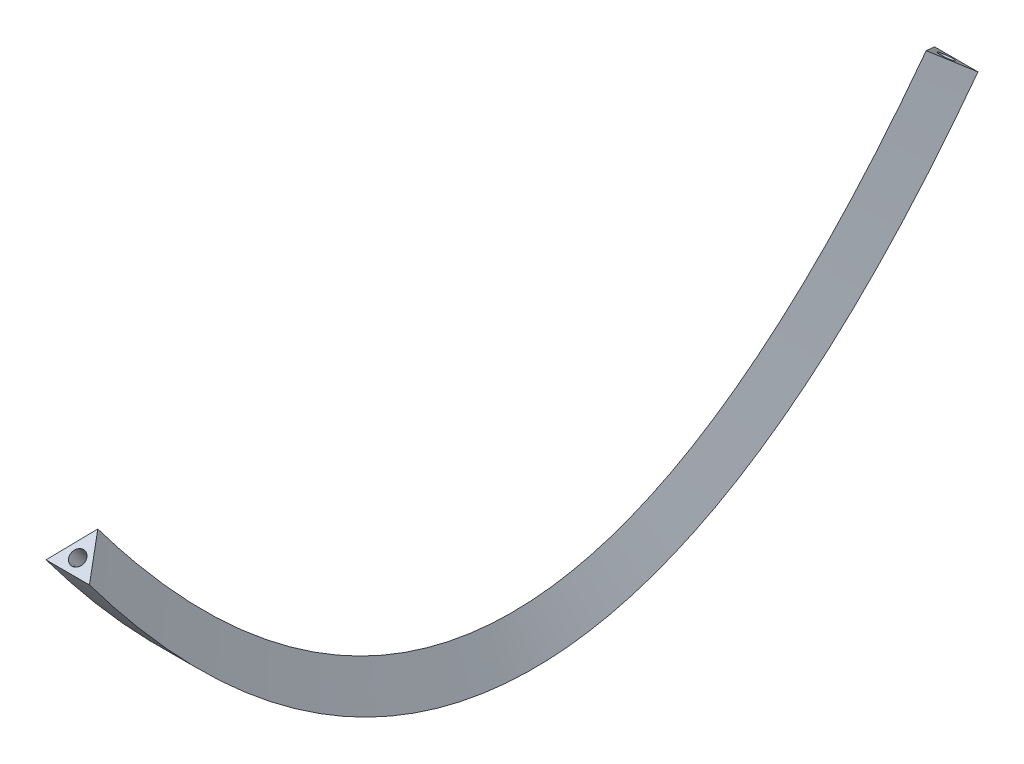
ISO-10303-21;
HEADER;
FILE_DESCRIPTION(('STEP AP214'),'2;1');
FILE_NAME('part.step','',(''),(''),'','','');
FILE_SCHEMA(('AUTOMOTIVE_DESIGN { 1 0 10303 214 1 1 1 1 }'));
ENDSEC;
DATA;
#1=APPLICATION_CONTEXT('core data for automotive mechanical design processes');
#2=APPLICATION_PROTOCOL_DEFINITION('international standard','automotive_design',2000,#1);
#3=PRODUCT_CONTEXT('',#1,'mechanical');
#4=PRODUCT('Part','Part','',(#3));
#5=PRODUCT_RELATED_PRODUCT_CATEGORY('part','',(#4));
#6=PRODUCT_DEFINITION_FORMATION('','',#4);
#7=PRODUCT_DEFINITION_CONTEXT('part definition',#1,'design');
#8=PRODUCT_DEFINITION('design','',#6,#7);
#9=PRODUCT_DEFINITION_SHAPE('','',#8);
#10=(LENGTH_UNIT() NAMED_UNIT(*) SI_UNIT(.MILLI.,.METRE.));
#11=(NAMED_UNIT(*) PLANE_ANGLE_UNIT() SI_UNIT($,.RADIAN.));
#12=(NAMED_UNIT(*) SI_UNIT($,.STERADIAN.) SOLID_ANGLE_UNIT());
#13=UNCERTAINTY_MEASURE_WITH_UNIT(LENGTH_MEASURE(1.E-05),#10,'distance_accuracy_value','');
#14=(GEOMETRIC_REPRESENTATION_CONTEXT(3) GLOBAL_UNCERTAINTY_ASSIGNED_CONTEXT((#13)) GLOBAL_UNIT_ASSIGNED_CONTEXT((#10,
#11,#12)) REPRESENTATION_CONTEXT('',''));
#15=CARTESIAN_POINT('',(0.,0.,0.));
#16=DIRECTION('',(0.,0.,1.));
#17=DIRECTION('',(1.,0.,0.));
#18=AXIS2_PLACEMENT_3D('',#15,#16,#17);
#19=CARTESIAN_POINT('',(15.,194.803847577293,-306.928203230275));
#20=CARTESIAN_POINT('',(15.,161.193482046376,-281.720429085412));
#21=CARTESIAN_POINT('',(15.,131.716475432373,-256.463922400366));
#22=CARTESIAN_POINT('',(15.,81.0360598245672,-205.783498417588));
#23=CARTESIAN_POINT('',(15.,59.8304179636023,-180.358110520362));
#24=CARTESIAN_POINT('',(15.,25.7580340814775,-129.249525894402));
#25=CARTESIAN_POINT('',(15.,12.8913522660172,-103.560167415296));
#26=CARTESIAN_POINT('',(15.,-4.32303403146759,-51.9170074384153));
#27=CARTESIAN_POINT('',(15.,-8.66025403780102,-25.9622360285769));
#28=CARTESIAN_POINT('',(15.,-8.66025403788775,25.9622648684316));
#29=CARTESIAN_POINT('',(15.,-4.323031917837,51.9170504644026));
#30=CARTESIAN_POINT('',(15.,12.8913602329809,103.560225832018));
#31=CARTESIAN_POINT('',(15.,25.7580457255587,129.249583807579));
#32=CARTESIAN_POINT('',(15.,59.8304345444556,180.358158234299));
#33=CARTESIAN_POINT('',(15.,81.0360776437553,205.783536477832));
#34=CARTESIAN_POINT('',(15.,131.716489671484,256.463940132063));
#35=CARTESIAN_POINT('',(15.,161.193491489031,281.720436168416));
#36=CARTESIAN_POINT('',(15.,194.803847577293,306.928203230275));
#37=CARTESIAN_POINT('',(0.,210.392304845413,-286.143593539449));
#38=CARTESIAN_POINT('',(0.,177.613022551272,-261.559131819855));
#39=CARTESIAN_POINT('',(0.,149.067029115684,-237.072129772899));
#40=CARTESIAN_POINT('',(0.,100.427855318388,-188.432947938692));
#41=CARTESIAN_POINT('',(0.,80.3391407120265,-164.283709368444));
#42=CARTESIAN_POINT('',(0.,48.4839151515491,-116.500862798088));
#43=CARTESIAN_POINT('',(0.,36.7172837878244,-92.8795783031034));
#44=CARTESIAN_POINT('',(0.,21.1460647257272,-46.1659201360645));
#45=CARTESIAN_POINT('',(0.,17.3205080757321,-23.0754862860122));
#46=CARTESIAN_POINT('',(0.,17.3205080756454,23.0755119191537));
#47=CARTESIAN_POINT('',(0.,21.1460671729631,46.1659640591198));
#48=CARTESIAN_POINT('',(0.,36.7172912141086,92.8796352015341));
#49=CARTESIAN_POINT('',(0.,48.4839252355572,116.500917797657));
#50=CARTESIAN_POINT('',(0.,80.3391542707064,164.283753122618));
#51=CARTESIAN_POINT('',(0.,100.427869743745,188.432982267045));
#52=CARTESIAN_POINT('',(0.,149.067040677855,237.072145165716));
#53=CARTESIAN_POINT('',(0.,177.61303036623,261.559137684254));
#54=CARTESIAN_POINT('',(0.,210.392304845413,286.143593539449));
#55=B_SPLINE_SURFACE_WITH_KNOTS('',1,3,((#19,#20,#21,#22,#23,#24,#25,#26,#27,#28,#29,#30,#31,
#32,#33,#34,#35,#36),(#37,#38,#39,#40,#41,#42,#43,#44,#45,#46,#47,#48,#49,#50,#51,#52,#53,#54)),
.UNSPECIFIED.,.F.,.F.,.F.,(2,2),(4,2,2,2,2,2,2,2,4),(0.,1.),(0.,0.124999930572624,
0.249999861145248,0.374999791717873,0.499999722290497,0.624999791717873,0.749999861145249,
0.874999930572624,1.),.UNSPECIFIED.);
#56=CARTESIAN_POINT('',(0.,210.392304845413,-286.143593539449));
#57=CARTESIAN_POINT('',(0.,177.613022551272,-261.559131819855));
#58=CARTESIAN_POINT('',(0.,149.067029115684,-237.072129772899));
#59=CARTESIAN_POINT('',(0.,100.427855318388,-188.432947938692));
#60=CARTESIAN_POINT('',(0.,80.3391407120265,-164.283709368444));
#61=CARTESIAN_POINT('',(0.,48.4839151515491,-116.500862798088));
#62=CARTESIAN_POINT('',(0.,36.7172837878244,-92.8795783031034));
#63=CARTESIAN_POINT('',(0.,21.1460647257272,-46.1659201360645));
#64=CARTESIAN_POINT('',(0.,17.3205080757321,-23.0754862860122));
#65=CARTESIAN_POINT('',(0.,17.3205080756454,23.0755119191537));
#66=CARTESIAN_POINT('',(0.,21.1460671729631,46.1659640591198));
#67=CARTESIAN_POINT('',(0.,36.7172912141086,92.8796352015341));
#68=CARTESIAN_POINT('',(0.,48.4839252355572,116.500917797657));
#69=CARTESIAN_POINT('',(0.,80.3391542707064,164.283753122618));
#70=CARTESIAN_POINT('',(0.,100.427869743745,188.432982267045));
#71=CARTESIAN_POINT('',(0.,149.067040677855,237.072145165716));
#72=CARTESIAN_POINT('',(0.,177.61303036623,261.559137684254));
#73=CARTESIAN_POINT('',(0.,210.392304845413,286.143593539449));
#74=B_SPLINE_CURVE_WITH_KNOTS('',3,(#56,#57,#58,#59,#60,#61,#62,#63,#64,#65,#66,#67,#68,#69,#70,
#71,#72,#73),.UNSPECIFIED.,.F.,.F.,(4,2,2,2,2,2,2,2,4),(0.,0.124999930572624,0.249999861145248,
0.374999791717873,0.499999722290497,0.624999791717873,0.749999861145249,0.874999930572624,1.),.UNSPECIFIED.);
#75=CARTESIAN_POINT('',(0.,210.392304845413,-286.143593539449));
#76=VERTEX_POINT('',#75);
#77=CARTESIAN_POINT('',(0.,210.392304845413,286.143593539449));
#78=VERTEX_POINT('',#77);
#79=EDGE_CURVE('E91',#76,#78,#74,.T.);
#80=DIRECTION('',(-0.5,0.519615242270663,-0.692820323027551));
#81=VECTOR('',#80,1.);
#82=CARTESIAN_POINT('',(15.,194.803847577293,306.928203230275));
#83=LINE('',#82,#81);
#84=CARTESIAN_POINT('',(15.,194.803847577293,306.928203230275));
#85=VERTEX_POINT('',#84);
#86=EDGE_CURVE('E88',#85,#78,#83,.T.);
#87=CARTESIAN_POINT('',(15.,194.803847577293,-306.928203230275));
#88=CARTESIAN_POINT('',(15.,161.193482046376,-281.720429085412));
#89=CARTESIAN_POINT('',(15.,131.716475432373,-256.463922400366));
#90=CARTESIAN_POINT('',(15.,81.0360598245672,-205.783498417588));
#91=CARTESIAN_POINT('',(15.,59.8304179636023,-180.358110520362));
#92=CARTESIAN_POINT('',(15.,25.7580340814775,-129.249525894402));
#93=CARTESIAN_POINT('',(15.,12.8913522660172,-103.560167415296));
#94=CARTESIAN_POINT('',(15.,-4.32303403146759,-51.9170074384153));
#95=CARTESIAN_POINT('',(15.,-8.66025403780102,-25.9622360285769));
#96=CARTESIAN_POINT('',(15.,-8.66025403788775,25.9622648684316));
#97=CARTESIAN_POINT('',(15.,-4.323031917837,51.9170504644026));
#98=CARTESIAN_POINT('',(15.,12.8913602329809,103.560225832018));
#99=CARTESIAN_POINT('',(15.,25.7580457255587,129.249583807579));
#100=CARTESIAN_POINT('',(15.,59.8304345444556,180.358158234299));
#101=CARTESIAN_POINT('',(15.,81.0360776437553,205.783536477832));
#102=CARTESIAN_POINT('',(15.,131.716489671484,256.463940132063));
#103=CARTESIAN_POINT('',(15.,161.193491489031,281.720436168416));
#104=CARTESIAN_POINT('',(15.,194.803847577293,306.928203230275));
#105=B_SPLINE_CURVE_WITH_KNOTS('',3,(#87,#88,#89,#90,#91,#92,#93,#94,#95,#96,#97,#98,#99,#100,
#101,#102,#103,#104),.UNSPECIFIED.,.F.,.F.,(4,2,2,2,2,2,2,2,4),(0.,0.124999930572624,
0.249999861145248,0.374999791717873,0.499999722290497,0.624999791717873,0.749999861145249,
0.874999930572624,1.),.UNSPECIFIED.);
#106=CARTESIAN_POINT('',(15.,194.803847577293,-306.928203230275));
#107=VERTEX_POINT('',#106);
#108=EDGE_CURVE('E89',#107,#85,#105,.T.);
#109=DIRECTION('',(-0.5,0.519615242270663,0.692820323027551));
#110=VECTOR('',#109,1.);
#111=CARTESIAN_POINT('',(15.,194.803847577293,-306.928203230275));
#112=LINE('',#111,#110);
#113=EDGE_CURVE('E100',#107,#76,#112,.T.);
#114=ORIENTED_EDGE('',*,*,#79,.T.);
#115=ORIENTED_EDGE('',*,*,#86,.F.);
#116=ORIENTED_EDGE('',*,*,#108,.F.);
#117=ORIENTED_EDGE('',*,*,#113,.T.);
#118=EDGE_LOOP('',(#114,#115,#116,#117));
#119=FACE_BOUND('',#118,.T.);
#120=ADVANCED_FACE('F33',(#119),#55,.T.);
#121=CARTESIAN_POINT('',(0.,210.392304845413,-286.143593539449));
#122=CARTESIAN_POINT('',(0.,177.613022551272,-261.559131819855));
#123=CARTESIAN_POINT('',(0.,149.067029115684,-237.072129772899));
#124=CARTESIAN_POINT('',(0.,100.427855318388,-188.432947938692));
#125=CARTESIAN_POINT('',(0.,80.339140712235,-164.283709368444));
#126=CARTESIAN_POINT('',(0.,48.4839151513407,-116.500862798088));
#127=CARTESIAN_POINT('',(0.,36.7172837878243,-92.8795783031034));
#128=CARTESIAN_POINT('',(0.,21.1460647257272,-46.1659201360645));
#129=CARTESIAN_POINT('',(0.,17.3205080757321,-23.0754862860122));
#130=CARTESIAN_POINT('',(0.,17.3205080756454,23.0755119191537));
#131=CARTESIAN_POINT('',(0.,21.1460671729631,46.1659640593027));
#132=CARTESIAN_POINT('',(0.,36.7172912141086,92.8796352013513));
#133=CARTESIAN_POINT('',(0.,48.4839252355572,116.500917798074));
#134=CARTESIAN_POINT('',(0.,80.3391542707064,164.283753122201));
#135=CARTESIAN_POINT('',(0.,100.427869743745,188.432982267535));
#136=CARTESIAN_POINT('',(0.,149.067040677855,237.072145165225));
#137=CARTESIAN_POINT('',(0.,177.613030366407,261.559137684386));
#138=CARTESIAN_POINT('',(0.,210.392304845413,286.143593539449));
#139=CARTESIAN_POINT('',(-15.,194.803847577293,-306.928203230275));
#140=CARTESIAN_POINT('',(-15.,161.193482046931,-281.720429084672));
#141=CARTESIAN_POINT('',(-15.,131.716475432373,-256.463922400366));
#142=CARTESIAN_POINT('',(-15.,81.0360598245672,-205.783498417588));
#143=CARTESIAN_POINT('',(-15.,59.8304179637065,-180.358110519945));
#144=CARTESIAN_POINT('',(-15.,25.7580340813733,-129.249525894819));
#145=CARTESIAN_POINT('',(-15.,12.8913522660172,-103.560167415296));
#146=CARTESIAN_POINT('',(-15.,-4.32303403146759,-51.9170074384153));
#147=CARTESIAN_POINT('',(-15.,-8.66025403780102,-25.9622360285769));
#148=CARTESIAN_POINT('',(-15.,-8.66025403788776,25.9622648684316));
#149=CARTESIAN_POINT('',(-15.,-4.323031917837,51.9170504644026));
#150=CARTESIAN_POINT('',(-15.,12.8913602329809,103.560225832018));
#151=CARTESIAN_POINT('',(-15.,25.7580457255587,129.249583807579));
#152=CARTESIAN_POINT('',(-15.,59.8304345444556,180.358158234299));
#153=CARTESIAN_POINT('',(-15.,81.0360776437553,205.783536477832));
#154=CARTESIAN_POINT('',(-15.,131.716489671484,256.463940132063));
#155=CARTESIAN_POINT('',(-15.,161.193491489031,281.720436168416));
#156=CARTESIAN_POINT('',(-15.,194.803847577293,306.928203230275));
#157=B_SPLINE_SURFACE_WITH_KNOTS('',1,3,((#121,#122,#123,#124,#125,#126,#127,#128,#129,#130,
#131,#132,#133,#134,#135,#136,#137,#138),(#139,#140,#141,#142,#143,#144,#145,#146,#147,#148,
#149,#150,#151,#152,#153,#154,#155,#156)),.UNSPECIFIED.,.F.,.F.,.F.,(2,2),(4,2,2,2,2,2,2,2,4),
(0.,1.),(0.,0.124999930572624,0.249999861145248,0.374999791717873,0.499999722290497,
0.624999791717873,0.749999861145249,0.874999930572624,1.),.UNSPECIFIED.);
#158=CARTESIAN_POINT('',(-15.,194.803847577293,-306.928203230275));
#159=CARTESIAN_POINT('',(-15.,161.193482046931,-281.720429084672));
#160=CARTESIAN_POINT('',(-15.,131.716475432373,-256.463922400366));
#161=CARTESIAN_POINT('',(-15.,81.0360598245672,-205.783498417588));
#162=CARTESIAN_POINT('',(-15.,59.8304179637065,-180.358110519945));
#163=CARTESIAN_POINT('',(-15.,25.7580340813733,-129.249525894819));
#164=CARTESIAN_POINT('',(-15.,12.8913522660172,-103.560167415296));
#165=CARTESIAN_POINT('',(-15.,-4.32303403146759,-51.9170074384153));
#166=CARTESIAN_POINT('',(-15.,-8.66025403780102,-25.9622360285769));
#167=CARTESIAN_POINT('',(-15.,-8.66025403788776,25.9622648684316));
#168=CARTESIAN_POINT('',(-15.,-4.323031917837,51.9170504644026));
#169=CARTESIAN_POINT('',(-15.,12.8913602329809,103.560225832018));
#170=CARTESIAN_POINT('',(-15.,25.7580457255587,129.249583807579));
#171=CARTESIAN_POINT('',(-15.,59.8304345444556,180.358158234299));
#172=CARTESIAN_POINT('',(-15.,81.0360776437553,205.783536477832));
#173=CARTESIAN_POINT('',(-15.,131.716489671484,256.463940132063));
#174=CARTESIAN_POINT('',(-15.,161.193491489031,281.720436168416));
#175=CARTESIAN_POINT('',(-15.,194.803847577293,306.928203230275));
#176=B_SPLINE_CURVE_WITH_KNOTS('',3,(#158,#159,#160,#161,#162,#163,#164,#165,#166,#167,#168,
#169,#170,#171,#172,#173,#174,#175),.UNSPECIFIED.,.F.,.F.,(4,2,2,2,2,2,2,2,4),(0.,
0.124999930572624,0.249999861145248,0.374999791717873,0.499999722290497,0.624999791717873,
0.749999861145249,0.874999930572624,1.),.UNSPECIFIED.);
#177=CARTESIAN_POINT('',(-15.,194.803847577293,-306.928203230275));
#178=VERTEX_POINT('',#177);
#179=CARTESIAN_POINT('',(-15.,194.803847577293,306.928203230275));
#180=VERTEX_POINT('',#179);
#181=EDGE_CURVE('E39',#178,#180,#176,.T.);
#182=DIRECTION('',(-0.5,-0.519615242270663,0.692820323027551));
#183=VECTOR('',#182,1.);
#184=CARTESIAN_POINT('',(0.,210.392304845413,286.143593539449));
#185=LINE('',#184,#183);
#186=EDGE_CURVE('E80',#78,#180,#185,.T.);
#187=DIRECTION('',(-0.5,-0.519615242270663,-0.692820323027551));
#188=VECTOR('',#187,1.);
#189=CARTESIAN_POINT('',(0.,210.392304845413,-286.143593539449));
#190=LINE('',#189,#188);
#191=EDGE_CURVE('E67',#76,#178,#190,.T.);
#192=ORIENTED_EDGE('',*,*,#181,.T.);
#193=ORIENTED_EDGE('',*,*,#186,.F.);
#194=ORIENTED_EDGE('',*,*,#79,.F.);
#195=ORIENTED_EDGE('',*,*,#191,.T.);
#196=EDGE_LOOP('',(#192,#193,#194,#195));
#197=FACE_BOUND('',#196,.T.);
#198=ADVANCED_FACE('F113',(#197),#157,.T.);
#199=CARTESIAN_POINT('',(-15.,194.803847577293,-306.928203230275));
#200=CARTESIAN_POINT('',(-15.,161.193482046931,-281.720429084672));
#201=CARTESIAN_POINT('',(-15.,131.716475432373,-256.463922400366));
#202=CARTESIAN_POINT('',(-15.,81.0360598245672,-205.783498417588));
#203=CARTESIAN_POINT('',(-15.,59.8304179637065,-180.358110519945));
#204=CARTESIAN_POINT('',(-15.,25.7580340813733,-129.249525894819));
#205=CARTESIAN_POINT('',(-15.,12.8913522660172,-103.560167415296));
#206=CARTESIAN_POINT('',(-15.,-4.32303403146759,-51.9170074384153));
#207=CARTESIAN_POINT('',(-15.,-8.66025403780102,-25.9622360285769));
#208=CARTESIAN_POINT('',(-15.,-8.66025403788776,25.9622648684316));
#209=CARTESIAN_POINT('',(-15.,-4.323031917837,51.9170504644026));
#210=CARTESIAN_POINT('',(-15.,12.8913602329809,103.560225832018));
#211=CARTESIAN_POINT('',(-15.,25.7580457255587,129.249583807579));
#212=CARTESIAN_POINT('',(-15.,59.8304345444556,180.358158234299));
#213=CARTESIAN_POINT('',(-15.,81.0360776437553,205.783536477832));
#214=CARTESIAN_POINT('',(-15.,131.716489671484,256.463940132063));
#215=CARTESIAN_POINT('',(-15.,161.193491489031,281.720436168416));
#216=CARTESIAN_POINT('',(-15.,194.803847577293,306.928203230275));
#217=CARTESIAN_POINT('',(15.,194.803847577293,-306.928203230275));
#218=CARTESIAN_POINT('',(15.,161.193482046376,-281.720429085412));
#219=CARTESIAN_POINT('',(15.,131.716475432373,-256.463922400366));
#220=CARTESIAN_POINT('',(15.,81.0360598245672,-205.783498417588));
#221=CARTESIAN_POINT('',(15.,59.8304179636023,-180.358110520362));
#222=CARTESIAN_POINT('',(15.,25.7580340814775,-129.249525894402));
#223=CARTESIAN_POINT('',(15.,12.8913522660172,-103.560167415296));
#224=CARTESIAN_POINT('',(15.,-4.32303403146759,-51.9170074384153));
#225=CARTESIAN_POINT('',(15.,-8.66025403780102,-25.9622360285769));
#226=CARTESIAN_POINT('',(15.,-8.66025403788775,25.9622648684316));
#227=CARTESIAN_POINT('',(15.,-4.323031917837,51.9170504644026));
#228=CARTESIAN_POINT('',(15.,12.8913602329809,103.560225832018));
#229=CARTESIAN_POINT('',(15.,25.7580457255587,129.249583807579));
#230=CARTESIAN_POINT('',(15.,59.8304345444556,180.358158234299));
#231=CARTESIAN_POINT('',(15.,81.0360776437553,205.783536477832));
#232=CARTESIAN_POINT('',(15.,131.716489671484,256.463940132063));
#233=CARTESIAN_POINT('',(15.,161.193491489031,281.720436168416));
#234=CARTESIAN_POINT('',(15.,194.803847577293,306.928203230275));
#235=B_SPLINE_SURFACE_WITH_KNOTS('',1,3,((#199,#200,#201,#202,#203,#204,#205,#206,#207,#208,
#209,#210,#211,#212,#213,#214,#215,#216),(#217,#218,#219,#220,#221,#222,#223,#224,#225,#226,
#227,#228,#229,#230,#231,#232,#233,#234)),.UNSPECIFIED.,.F.,.F.,.F.,(2,2),(4,2,2,2,2,2,2,2,4),
(0.,1.),(0.,0.124999930572624,0.249999861145248,0.374999791717873,0.499999722290497,
0.624999791717873,0.749999861145249,0.874999930572624,1.),.UNSPECIFIED.);
#236=DIRECTION('',(1.,0.,0.));
#237=VECTOR('',#236,1.);
#238=CARTESIAN_POINT('',(-15.,194.803847577293,306.928203230275));
#239=LINE('',#238,#237);
#240=EDGE_CURVE('E84',#180,#85,#239,.T.);
#241=DIRECTION('',(1.,0.,0.));
#242=VECTOR('',#241,1.);
#243=CARTESIAN_POINT('',(-15.,194.803847577293,-306.928203230275));
#244=LINE('',#243,#242);
#245=EDGE_CURVE('E74',#178,#107,#244,.T.);
#246=ORIENTED_EDGE('',*,*,#240,.F.);
#247=ORIENTED_EDGE('',*,*,#181,.F.);
#248=ORIENTED_EDGE('',*,*,#245,.T.);
#249=ORIENTED_EDGE('',*,*,#108,.T.);
#250=EDGE_LOOP('',(#246,#247,#248,#249));
#251=FACE_BOUND('',#250,.T.);
#252=ADVANCED_FACE('F35',(#251),#235,.T.);
#253=CARTESIAN_POINT('',(0.,200.,-300.));
#254=DIRECTION('',(0.,-0.8,0.6));
#255=DIRECTION('',(1.,0.,0.));
#256=AXIS2_PLACEMENT_3D('',#253,#254,#255);
#257=PLANE('',#256);
#258=CARTESIAN_POINT('',(0.,200.,-300.));
#259=DIRECTION('',(0.,-0.8,0.6));
#260=DIRECTION('',(1.,0.,0.));
#261=AXIS2_PLACEMENT_3D('',#258,#259,#260);
#262=CIRCLE('',#261,5.);
#263=CARTESIAN_POINT('',(5.,200.,-300.));
#264=VERTEX_POINT('',#263);
#265=EDGE_CURVE('E47',#264,#264,#262,.F.);
#266=ORIENTED_EDGE('',*,*,#265,.F.);
#267=EDGE_LOOP('',(#266));
#268=FACE_BOUND('',#267,.T.);
#269=ORIENTED_EDGE('',*,*,#113,.F.);
#270=ORIENTED_EDGE('',*,*,#245,.F.);
#271=ORIENTED_EDGE('',*,*,#191,.F.);
#272=EDGE_LOOP('',(#269,#270,#271));
#273=FACE_BOUND('',#272,.T.);
#274=ADVANCED_FACE('F115',(#268,#273),#257,.F.);
#275=CARTESIAN_POINT('',(0.,200.,300.));
#276=DIRECTION('',(0.,0.8,0.6));
#277=DIRECTION('',(1.,0.,0.));
#278=AXIS2_PLACEMENT_3D('',#275,#276,#277);
#279=PLANE('',#278);
#280=CARTESIAN_POINT('',(0.,200.,300.));
#281=DIRECTION('',(0.,0.8,0.6));
#282=DIRECTION('',(1.,0.,0.));
#283=AXIS2_PLACEMENT_3D('',#280,#281,#282);
#284=CIRCLE('',#283,5.);
#285=CARTESIAN_POINT('',(5.,200.,300.));
#286=VERTEX_POINT('',#285);
#287=EDGE_CURVE('E11',#286,#286,#284,.F.);
#288=ORIENTED_EDGE('',*,*,#287,.T.);
#289=EDGE_LOOP('',(#288));
#290=FACE_BOUND('',#289,.T.);
#291=ORIENTED_EDGE('',*,*,#86,.T.);
#292=ORIENTED_EDGE('',*,*,#186,.T.);
#293=ORIENTED_EDGE('',*,*,#240,.T.);
#294=EDGE_LOOP('',(#291,#292,#293));
#295=FACE_BOUND('',#294,.T.);
#296=ADVANCED_FACE('F94',(#290,#295),#279,.T.);
#297=CARTESIAN_POINT('',(5.,200.,-300.));
#298=CARTESIAN_POINT('',(5.,133.33332443109,-249.999993324185));
#299=CARTESIAN_POINT('',(5.,83.3333244339344,-199.999979439546));
#300=CARTESIAN_POINT('',(5.,33.3333277714666,-124.999971529242));
#301=CARTESIAN_POINT('',(5.,20.8333294399529,-99.9999710445654));
#302=CARTESIAN_POINT('',(5.,4.16666555426402,-49.9999783376317));
#303=CARTESIAN_POINT('',(5.,4.68820623262793E-11,-24.9999861143887));
#304=CARTESIAN_POINT('',(5.,-4.68821144046851E-11,25.000013885339));
#305=CARTESIAN_POINT('',(5.,4.16666777908113,50.0000216626417));
#306=CARTESIAN_POINT('',(5.,20.8333372267054,100.00002895519));
#307=CARTESIAN_POINT('',(5.,33.3333388955582,125.000028470938));
#308=CARTESIAN_POINT('',(5.,83.3333422320298,200.000020560139));
#309=CARTESIAN_POINT('',(5.,133.333342239715,250.000006682966));
#310=CARTESIAN_POINT('',(5.,200.,300.));
#311=CARTESIAN_POINT('',(5.,194.,-308.));
#312=CARTESIAN_POINT('',(5.,126.693323805825,-257.51999285726));
#313=CARTESIAN_POINT('',(5.,75.8662056855368,-206.827057915058));
#314=CARTESIAN_POINT('',(5.,24.5861320692077,-129.906934242779));
#315=CARTESIAN_POINT('',(5.,11.66272412142,-104.110931710536));
#316=CARTESIAN_POINT('',(5.,-5.63639512806479,-52.2135728724435));
#317=CARTESIAN_POINT('',(5.,-9.99999999995312,-26.1110966083572));
#318=CARTESIAN_POINT('',(5.,-10.0000000000469,26.111125613572));
#319=CARTESIAN_POINT('',(5.,-5.63639303162001,52.2136158521533));
#320=CARTESIAN_POINT('',(5.,11.6627321162477,104.110990205569));
#321=CARTESIAN_POINT('',(5.,24.5861437937564,129.906992305898));
#322=CARTESIAN_POINT('',(5.,75.8662249282791,206.827100761148));
#323=CARTESIAN_POINT('',(5.,126.693342865478,257.520007153735));
#324=CARTESIAN_POINT('',(5.,194.,308.));
#325=CARTESIAN_POINT('',(-5.,194.,-308.));
#326=CARTESIAN_POINT('',(-5.,126.693323805825,-257.51999285726));
#327=CARTESIAN_POINT('',(-5.,75.8662056855368,-206.827057915058));
#328=CARTESIAN_POINT('',(-5.,24.5861320692077,-129.906934242779));
#329=CARTESIAN_POINT('',(-5.,11.66272412142,-104.110931710536));
#330=CARTESIAN_POINT('',(-5.,-5.63639512806479,-52.2135728724435));
#331=CARTESIAN_POINT('',(-5.,-9.99999999995312,-26.1110966083572));
#332=CARTESIAN_POINT('',(-5.,-10.0000000000469,26.111125613572));
#333=CARTESIAN_POINT('',(-5.,-5.63639303162001,52.2136158521533));
#334=CARTESIAN_POINT('',(-5.,11.6627321162477,104.110990205569));
#335=CARTESIAN_POINT('',(-5.,24.5861437937564,129.906992305898));
#336=CARTESIAN_POINT('',(-5.,75.8662249282791,206.827100761148));
#337=CARTESIAN_POINT('',(-5.,126.693342865478,257.520007153735));
#338=CARTESIAN_POINT('',(-5.,194.,308.));
#339=CARTESIAN_POINT('',(-5.,200.,-300.));
#340=CARTESIAN_POINT('',(-5.,133.33332443109,-249.999993324185));
#341=CARTESIAN_POINT('',(-5.,83.3333244339344,-199.999979439546));
#342=CARTESIAN_POINT('',(-5.,33.3333277714666,-124.999971529242));
#343=CARTESIAN_POINT('',(-5.,20.8333294399529,-99.9999710445654));
#344=CARTESIAN_POINT('',(-5.,4.16666555426402,-49.9999783376317));
#345=CARTESIAN_POINT('',(-5.,4.68826746496788E-11,-24.9999861143887));
#346=CARTESIAN_POINT('',(-5.,-4.68815020812855E-11,25.000013885339));
#347=CARTESIAN_POINT('',(-5.,4.16666777908113,50.0000216626417));
#348=CARTESIAN_POINT('',(-5.,20.8333372267054,100.00002895519));
#349=CARTESIAN_POINT('',(-5.,33.3333388955582,125.000028470938));
#350=CARTESIAN_POINT('',(-5.,83.3333422320298,200.000020560139));
#351=CARTESIAN_POINT('',(-5.,133.333342239715,250.000006682966));
#352=CARTESIAN_POINT('',(-5.,200.,300.));
#353=CARTESIAN_POINT('',(-5.,206.,-292.));
#354=CARTESIAN_POINT('',(-5.,139.973325056355,-242.47999379111));
#355=CARTESIAN_POINT('',(-5.,90.8004431823319,-193.172900964034));
#356=CARTESIAN_POINT('',(-5.,42.0805234737256,-120.093008815705));
#357=CARTESIAN_POINT('',(-5.,30.0039347584858,-95.8890103785947));
#358=CARTESIAN_POINT('',(-5.,13.9697262365928,-47.7863838028199));
#359=CARTESIAN_POINT('',(-5.,10.0000000000469,-23.8888756204201));
#360=CARTESIAN_POINT('',(-5.,9.99999999995312,23.888902157106));
#361=CARTESIAN_POINT('',(-5.,13.9697285897823,47.78642747313));
#362=CARTESIAN_POINT('',(-5.,30.003942337163,95.8890677048104));
#363=CARTESIAN_POINT('',(-5.,42.0805339973599,120.093064635979));
#364=CARTESIAN_POINT('',(-5.,90.8004595357804,193.172940359129));
#365=CARTESIAN_POINT('',(-5.,139.973341613951,242.480006212198));
#366=CARTESIAN_POINT('',(-5.,206.,292.));
#367=CARTESIAN_POINT('',(5.,206.,-292.));
#368=CARTESIAN_POINT('',(5.,139.973325056355,-242.47999379111));
#369=CARTESIAN_POINT('',(5.,90.8004431823319,-193.172900964034));
#370=CARTESIAN_POINT('',(5.,42.0805234737256,-120.093008815705));
#371=CARTESIAN_POINT('',(5.,30.0039347584858,-95.8890103785947));
#372=CARTESIAN_POINT('',(5.,13.9697262365928,-47.7863838028199));
#373=CARTESIAN_POINT('',(5.,10.0000000000469,-23.8888756204201));
#374=CARTESIAN_POINT('',(5.,9.99999999995312,23.888902157106));
#375=CARTESIAN_POINT('',(5.,13.9697285897823,47.78642747313));
#376=CARTESIAN_POINT('',(5.,30.003942337163,95.8890677048104));
#377=CARTESIAN_POINT('',(5.,42.0805339973599,120.093064635979));
#378=CARTESIAN_POINT('',(5.,90.8004595357804,193.172940359129));
#379=CARTESIAN_POINT('',(5.,139.973341613951,242.480006212198));
#380=CARTESIAN_POINT('',(5.,206.,292.));
#381=CARTESIAN_POINT('',(5.,200.,-300.));
#382=CARTESIAN_POINT('',(5.,133.33332443109,-249.999993324185));
#383=CARTESIAN_POINT('',(5.,83.3333244339344,-199.999979439546));
#384=CARTESIAN_POINT('',(5.,33.3333277714666,-124.999971529242));
#385=CARTESIAN_POINT('',(5.,20.8333294399529,-99.9999710445654));
#386=CARTESIAN_POINT('',(5.,4.16666555426402,-49.9999783376317));
#387=CARTESIAN_POINT('',(5.,4.68820623262793E-11,-24.9999861143887));
#388=CARTESIAN_POINT('',(5.,-4.68821144046851E-11,25.000013885339));
#389=CARTESIAN_POINT('',(5.,4.16666777908113,50.0000216626417));
#390=CARTESIAN_POINT('',(5.,20.8333372267054,100.00002895519));
#391=CARTESIAN_POINT('',(5.,33.3333388955582,125.000028470938));
#392=CARTESIAN_POINT('',(5.,83.3333422320298,200.000020560139));
#393=CARTESIAN_POINT('',(5.,133.333342239715,250.000006682966));
#394=CARTESIAN_POINT('',(5.,200.,300.));
#395=(BOUNDED_SURFACE() B_SPLINE_SURFACE(3,3,((#297,#298,#299,#300,#301,#302,#303,#304,#305,
#306,#307,#308,#309,#310),(#311,#312,#313,#314,#315,#316,#317,#318,#319,#320,#321,#322,#323,
#324),(#325,#326,#327,#328,#329,#330,#331,#332,#333,#334,#335,#336,#337,#338),(#339,#340,#341,
#342,#343,#344,#345,#346,#347,#348,#349,#350,#351,#352),(#353,#354,#355,#356,#357,#358,#359,
#360,#361,#362,#363,#364,#365,#366),(#367,#368,#369,#370,#371,#372,#373,#374,#375,#376,#377,
#378,#379,#380),(#381,#382,#383,#384,#385,#386,#387,#388,#389,#390,#391,#392,#393,#394)),
.UNSPECIFIED.,.T.,.F.,.F.) B_SPLINE_SURFACE_WITH_KNOTS((4,3,4),(4,2,2,2,2,2,4),(0.,0.5,1.),(0.,
0.249999861145248,0.374999791717873,0.499999722290497,0.624999791717873,0.749999861145249,1.),
.UNSPECIFIED.) GEOMETRIC_REPRESENTATION_ITEM() RATIONAL_B_SPLINE_SURFACE(((1.,1.,1.,1.,1.,1.,1.,
1.,1.,1.,1.,1.,1.,1.),(0.333333333333333,0.333333333333333,0.333333333333333,0.333333333333333,
0.333333333333333,0.333333333333333,0.333333333333333,0.333333333333333,0.333333333333333,
0.333333333333333,0.333333333333333,0.333333333333333,0.333333333333333,0.333333333333333),
(0.333333333333333,0.333333333333333,0.333333333333333,0.333333333333333,0.333333333333333,
0.333333333333333,0.333333333333333,0.333333333333333,0.333333333333333,0.333333333333333,
0.333333333333333,0.333333333333333,0.333333333333333,0.333333333333333),(1.,1.,1.,1.,1.,1.,1.,
1.,1.,1.,1.,1.,1.,1.),(0.333333333333333,0.333333333333333,0.333333333333333,0.333333333333333,
0.333333333333333,0.333333333333333,0.333333333333333,0.333333333333333,0.333333333333333,
0.333333333333333,0.333333333333333,0.333333333333333,0.333333333333333,0.333333333333333),
(0.333333333333333,0.333333333333333,0.333333333333333,0.333333333333333,0.333333333333333,
0.333333333333333,0.333333333333333,0.333333333333333,0.333333333333333,0.333333333333333,
0.333333333333333,0.333333333333333,0.333333333333333,0.333333333333333),(1.,1.,1.,1.,1.,1.,1.,
1.,1.,1.,1.,1.,1.,1.))) REPRESENTATION_ITEM('') SURFACE());
#396=ORIENTED_EDGE('',*,*,#287,.F.);
#397=EDGE_LOOP('',(#396));
#398=FACE_BOUND('',#397,.T.);
#399=ORIENTED_EDGE('',*,*,#265,.T.);
#400=EDGE_LOOP('',(#399));
#401=FACE_BOUND('',#400,.T.);
#402=ADVANCED_FACE('F122',(#398,#401),#395,.T.);
#403=CLOSED_SHELL('',(#120,#198,#252,#274,#296,#402));
#404=MANIFOLD_SOLID_BREP('B2',#403);
#405=ADVANCED_BREP_SHAPE_REPRESENTATION('',(#18,#404),#14);
#406=SHAPE_DEFINITION_REPRESENTATION(#9,#405);
ENDSEC;
END-ISO-10303-21;
